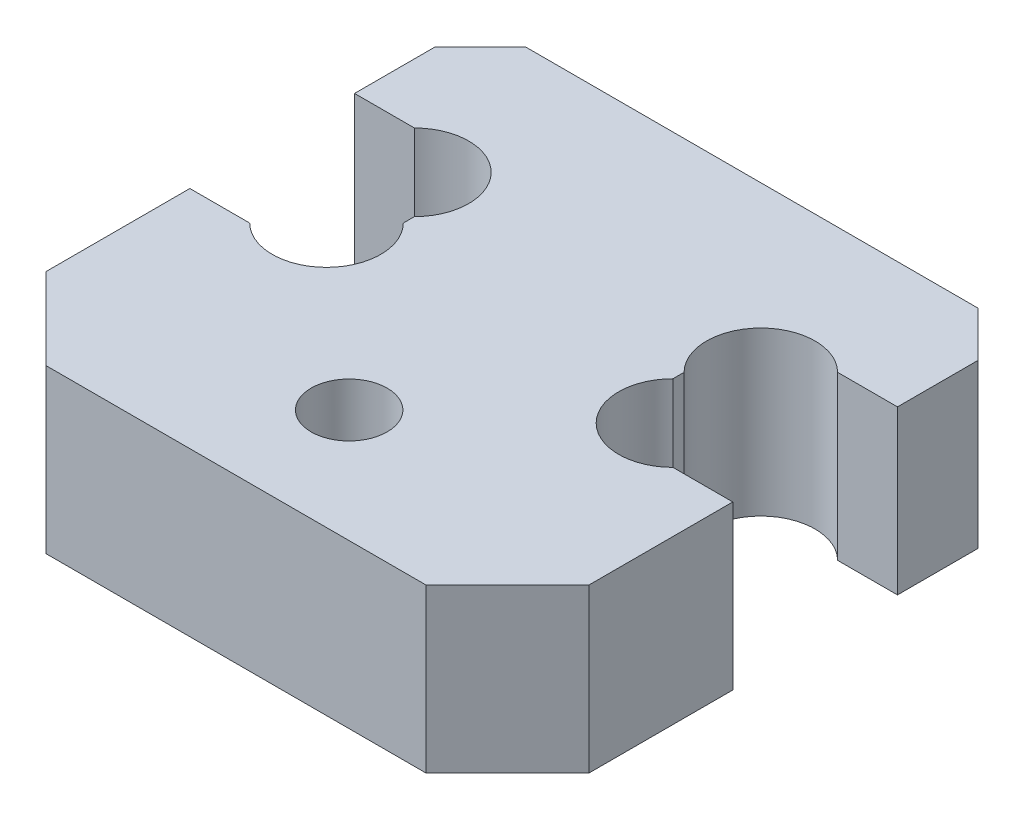
ISO-10303-21;
HEADER;
FILE_DESCRIPTION(('STEP AP214'),'2;1');
FILE_NAME('part.step','',(''),(''),'','','');
FILE_SCHEMA(('AUTOMOTIVE_DESIGN { 1 0 10303 214 1 1 1 1 }'));
ENDSEC;
DATA;
#1=APPLICATION_CONTEXT('core data for automotive mechanical design processes');
#2=APPLICATION_PROTOCOL_DEFINITION('international standard','automotive_design',2000,#1);
#3=PRODUCT_CONTEXT('',#1,'mechanical');
#4=PRODUCT('Part','Part','',(#3));
#5=PRODUCT_RELATED_PRODUCT_CATEGORY('part','',(#4));
#6=PRODUCT_DEFINITION_FORMATION('','',#4);
#7=PRODUCT_DEFINITION_CONTEXT('part definition',#1,'design');
#8=PRODUCT_DEFINITION('design','',#6,#7);
#9=PRODUCT_DEFINITION_SHAPE('','',#8);
#10=(LENGTH_UNIT() NAMED_UNIT(*) SI_UNIT(.MILLI.,.METRE.));
#11=(NAMED_UNIT(*) PLANE_ANGLE_UNIT() SI_UNIT($,.RADIAN.));
#12=(NAMED_UNIT(*) SI_UNIT($,.STERADIAN.) SOLID_ANGLE_UNIT());
#13=UNCERTAINTY_MEASURE_WITH_UNIT(LENGTH_MEASURE(1.E-05),#10,'distance_accuracy_value','');
#14=(GEOMETRIC_REPRESENTATION_CONTEXT(3) GLOBAL_UNCERTAINTY_ASSIGNED_CONTEXT((#13)) GLOBAL_UNIT_ASSIGNED_CONTEXT((#10,
#11,#12)) REPRESENTATION_CONTEXT('',''));
#15=CARTESIAN_POINT('',(0.,0.,0.));
#16=DIRECTION('',(0.,0.,1.));
#17=DIRECTION('',(1.,0.,0.));
#18=AXIS2_PLACEMENT_3D('',#15,#16,#17);
#19=CARTESIAN_POINT('',(9.57132034355964,115.062,2.07132034355965));
#20=DIRECTION('',(0.,-1.,0.));
#21=DIRECTION('',(0.,0.,-1.));
#22=AXIS2_PLACEMENT_3D('',#19,#20,#21);
#23=CYLINDRICAL_SURFACE('',#22,3.);
#24=DIRECTION('',(0.,-1.,0.));
#25=VECTOR('',#24,1.);
#26=CARTESIAN_POINT('',(11.6926406871193,115.062,-0.05));
#27=LINE('',#26,#25);
#28=CARTESIAN_POINT('',(11.6926406871193,115.06,-0.05));
#29=VERTEX_POINT('',#28);
#30=CARTESIAN_POINT('',(11.6926406871193,106.06,-0.05));
#31=VERTEX_POINT('',#30);
#32=EDGE_CURVE('E354',#29,#31,#27,.T.);
#33=ORIENTED_EDGE('',*,*,#32,.F.);
#34=CARTESIAN_POINT('',(9.57132034355964,115.06,2.07132034355965));
#35=DIRECTION('',(0.,1.,0.));
#36=DIRECTION('',(0.,0.,1.));
#37=AXIS2_PLACEMENT_3D('',#34,#35,#36);
#38=CIRCLE('',#37,3.);
#39=CARTESIAN_POINT('',(7.45,115.06,4.19264068711929));
#40=VERTEX_POINT('',#39);
#41=EDGE_CURVE('E303',#29,#40,#38,.T.);
#42=ORIENTED_EDGE('',*,*,#41,.T.);
#43=DIRECTION('',(0.,-1.,0.));
#44=VECTOR('',#43,1.);
#45=CARTESIAN_POINT('',(7.45,115.062,4.19264068711929));
#46=LINE('',#45,#44);
#47=CARTESIAN_POINT('',(7.45,106.06,4.19264068711929));
#48=VERTEX_POINT('',#47);
#49=EDGE_CURVE('E351',#40,#48,#46,.T.);
#50=ORIENTED_EDGE('',*,*,#49,.T.);
#51=CARTESIAN_POINT('',(9.57132034355964,106.06,2.07132034355965));
#52=DIRECTION('',(0.,1.,0.));
#53=DIRECTION('',(0.,0.,-1.));
#54=AXIS2_PLACEMENT_3D('',#51,#52,#53);
#55=CIRCLE('',#54,3.);
#56=EDGE_CURVE('E298',#31,#48,#55,.T.);
#57=ORIENTED_EDGE('',*,*,#56,.F.);
#58=EDGE_LOOP('',(#33,#42,#50,#57));
#59=FACE_BOUND('',#58,.T.);
#60=ADVANCED_FACE('F16',(#59),#23,.F.);
#61=CARTESIAN_POINT('',(-9.57132034355964,115.062,2.07132034355963));
#62=DIRECTION('',(0.,-1.,0.));
#63=DIRECTION('',(0.,0.,-1.));
#64=AXIS2_PLACEMENT_3D('',#61,#62,#63);
#65=CYLINDRICAL_SURFACE('',#64,3.);
#66=CARTESIAN_POINT('',(-9.57132034355964,106.06,2.07132034355963));
#67=DIRECTION('',(0.,-1.,0.));
#68=DIRECTION('',(0.,0.,-1.));
#69=AXIS2_PLACEMENT_3D('',#66,#67,#68);
#70=CIRCLE('',#69,3.);
#71=CARTESIAN_POINT('',(-11.6926406871193,106.06,-0.05));
#72=VERTEX_POINT('',#71);
#73=CARTESIAN_POINT('',(-7.45,106.06,4.19264068711928));
#74=VERTEX_POINT('',#73);
#75=EDGE_CURVE('E309',#72,#74,#70,.T.);
#76=ORIENTED_EDGE('',*,*,#75,.T.);
#77=DIRECTION('',(0.,-1.,0.));
#78=VECTOR('',#77,1.);
#79=CARTESIAN_POINT('',(-7.45,115.062,4.19264068711928));
#80=LINE('',#79,#78);
#81=CARTESIAN_POINT('',(-7.45,115.06,4.19264068711928));
#82=VERTEX_POINT('',#81);
#83=EDGE_CURVE('E279',#82,#74,#80,.T.);
#84=ORIENTED_EDGE('',*,*,#83,.F.);
#85=CARTESIAN_POINT('',(-9.57132034355964,115.06,2.07132034355963));
#86=DIRECTION('',(0.,-1.,0.));
#87=DIRECTION('',(0.,0.,1.));
#88=AXIS2_PLACEMENT_3D('',#85,#86,#87);
#89=CIRCLE('',#88,3.);
#90=CARTESIAN_POINT('',(-11.6926406871193,115.06,-0.05));
#91=VERTEX_POINT('',#90);
#92=EDGE_CURVE('E406',#91,#82,#89,.T.);
#93=ORIENTED_EDGE('',*,*,#92,.F.);
#94=DIRECTION('',(0.,-1.,0.));
#95=VECTOR('',#94,1.);
#96=CARTESIAN_POINT('',(-11.6926406871193,115.062,-0.05));
#97=LINE('',#96,#95);
#98=EDGE_CURVE('E276',#91,#72,#97,.T.);
#99=ORIENTED_EDGE('',*,*,#98,.T.);
#100=EDGE_LOOP('',(#76,#84,#93,#99));
#101=FACE_BOUND('',#100,.T.);
#102=ADVANCED_FACE('F466',(#101),#65,.F.);
#103=CARTESIAN_POINT('',(-9.57132034355964,115.062,6.92867965644036));
#104=DIRECTION('',(0.,-1.,0.));
#105=DIRECTION('',(0.,0.,-1.));
#106=AXIS2_PLACEMENT_3D('',#103,#104,#105);
#107=CYLINDRICAL_SURFACE('',#106,3.);
#108=CARTESIAN_POINT('',(-9.57132034355964,115.06,6.92867965644036));
#109=DIRECTION('',(0.,1.,0.));
#110=DIRECTION('',(0.,0.,1.));
#111=AXIS2_PLACEMENT_3D('',#108,#109,#110);
#112=CIRCLE('',#111,3.);
#113=CARTESIAN_POINT('',(-11.6926406871193,115.06,9.05));
#114=VERTEX_POINT('',#113);
#115=CARTESIAN_POINT('',(-7.45,115.06,4.80735931288072));
#116=VERTEX_POINT('',#115);
#117=EDGE_CURVE('E316',#114,#116,#112,.T.);
#118=ORIENTED_EDGE('',*,*,#117,.T.);
#119=DIRECTION('',(0.,-1.,0.));
#120=VECTOR('',#119,1.);
#121=CARTESIAN_POINT('',(-7.45,115.062,4.80735931288072));
#122=LINE('',#121,#120);
#123=CARTESIAN_POINT('',(-7.45,106.06,4.80735931288072));
#124=VERTEX_POINT('',#123);
#125=EDGE_CURVE('E244',#116,#124,#122,.T.);
#126=ORIENTED_EDGE('',*,*,#125,.T.);
#127=CARTESIAN_POINT('',(-9.57132034355964,106.06,6.92867965644036));
#128=DIRECTION('',(0.,1.,0.));
#129=DIRECTION('',(0.,0.,-1.));
#130=AXIS2_PLACEMENT_3D('',#127,#128,#129);
#131=CIRCLE('',#130,3.);
#132=CARTESIAN_POINT('',(-11.6926406871193,106.06,9.05));
#133=VERTEX_POINT('',#132);
#134=EDGE_CURVE('E247',#133,#124,#131,.T.);
#135=ORIENTED_EDGE('',*,*,#134,.F.);
#136=DIRECTION('',(0.,-1.,0.));
#137=VECTOR('',#136,1.);
#138=CARTESIAN_POINT('',(-11.6926406871193,115.062,9.05));
#139=LINE('',#138,#137);
#140=EDGE_CURVE('E232',#114,#133,#139,.T.);
#141=ORIENTED_EDGE('',*,*,#140,.F.);
#142=EDGE_LOOP('',(#118,#126,#135,#141));
#143=FACE_BOUND('',#142,.T.);
#144=ADVANCED_FACE('F248',(#143),#107,.F.);
#145=CARTESIAN_POINT('',(9.57132034355964,115.062,6.92867965644036));
#146=DIRECTION('',(0.,-1.,0.));
#147=DIRECTION('',(0.,0.,-1.));
#148=AXIS2_PLACEMENT_3D('',#145,#146,#147);
#149=CYLINDRICAL_SURFACE('',#148,3.);
#150=CARTESIAN_POINT('',(9.57132034355964,115.06,6.92867965644036));
#151=DIRECTION('',(0.,-1.,0.));
#152=DIRECTION('',(0.,0.,1.));
#153=AXIS2_PLACEMENT_3D('',#150,#151,#152);
#154=CIRCLE('',#153,3.);
#155=CARTESIAN_POINT('',(11.6926406871193,115.06,9.05));
#156=VERTEX_POINT('',#155);
#157=CARTESIAN_POINT('',(7.45,115.06,4.80735931288072));
#158=VERTEX_POINT('',#157);
#159=EDGE_CURVE('E304',#156,#158,#154,.T.);
#160=ORIENTED_EDGE('',*,*,#159,.F.);
#161=DIRECTION('',(0.,-1.,0.));
#162=VECTOR('',#161,1.);
#163=CARTESIAN_POINT('',(11.6926406871193,115.062,9.05));
#164=LINE('',#163,#162);
#165=CARTESIAN_POINT('',(11.6926406871193,106.06,9.05));
#166=VERTEX_POINT('',#165);
#167=EDGE_CURVE('E11',#156,#166,#164,.T.);
#168=ORIENTED_EDGE('',*,*,#167,.T.);
#169=CARTESIAN_POINT('',(9.57132034355964,106.06,6.92867965644036));
#170=DIRECTION('',(0.,-1.,0.));
#171=DIRECTION('',(0.,0.,-1.));
#172=AXIS2_PLACEMENT_3D('',#169,#170,#171);
#173=CIRCLE('',#172,3.);
#174=CARTESIAN_POINT('',(7.45,106.06,4.80735931288072));
#175=VERTEX_POINT('',#174);
#176=EDGE_CURVE('E308',#166,#175,#173,.T.);
#177=ORIENTED_EDGE('',*,*,#176,.T.);
#178=DIRECTION('',(0.,-1.,0.));
#179=VECTOR('',#178,1.);
#180=CARTESIAN_POINT('',(7.45,115.062,4.80735931288072));
#181=LINE('',#180,#179);
#182=EDGE_CURVE('E355',#158,#175,#181,.T.);
#183=ORIENTED_EDGE('',*,*,#182,.F.);
#184=EDGE_LOOP('',(#160,#168,#177,#183));
#185=FACE_BOUND('',#184,.T.);
#186=ADVANCED_FACE('F490',(#185),#149,.F.);
#187=CARTESIAN_POINT('',(0.,115.062,15.25));
#188=DIRECTION('',(0.,-1.,0.));
#189=DIRECTION('',(0.,0.,-1.));
#190=AXIS2_PLACEMENT_3D('',#187,#188,#189);
#191=CYLINDRICAL_SURFACE('',#190,2.1);
#192=CARTESIAN_POINT('',(0.,115.06,15.25));
#193=DIRECTION('',(0.,-1.,0.));
#194=DIRECTION('',(0.,0.,1.));
#195=AXIS2_PLACEMENT_3D('',#192,#193,#194);
#196=CIRCLE('',#195,2.1);
#197=CARTESIAN_POINT('',(0.,115.06,17.35));
#198=VERTEX_POINT('',#197);
#199=EDGE_CURVE('E297',#198,#198,#196,.T.);
#200=ORIENTED_EDGE('',*,*,#199,.F.);
#201=EDGE_LOOP('',(#200));
#202=FACE_BOUND('',#201,.T.);
#203=CARTESIAN_POINT('',(0.,106.06,15.25));
#204=DIRECTION('',(0.,-1.,0.));
#205=DIRECTION('',(0.,0.,-1.));
#206=AXIS2_PLACEMENT_3D('',#203,#204,#205);
#207=CIRCLE('',#206,2.1);
#208=CARTESIAN_POINT('',(0.,106.06,13.15));
#209=VERTEX_POINT('',#208);
#210=EDGE_CURVE('E305',#209,#209,#207,.T.);
#211=ORIENTED_EDGE('',*,*,#210,.T.);
#212=EDGE_LOOP('',(#211));
#213=FACE_BOUND('',#212,.T.);
#214=ADVANCED_FACE('F18',(#202,#213),#191,.F.);
#215=CARTESIAN_POINT('',(10.5,26.7449246614837,21.5));
#216=DIRECTION('',(0.707106781186548,0.,0.707106781186548));
#217=DIRECTION('',(0.,-1.,0.));
#218=AXIS2_PLACEMENT_3D('',#215,#216,#217);
#219=PLANE('',#218);
#220=DIRECTION('',(-0.707106781186548,0.,0.707106781186548));
#221=VECTOR('',#220,1.);
#222=CARTESIAN_POINT('',(10.5,106.06,21.5));
#223=LINE('',#222,#221);
#224=CARTESIAN_POINT('',(15.,106.06,17.));
#225=VERTEX_POINT('',#224);
#226=CARTESIAN_POINT('',(10.5,106.06,21.5));
#227=VERTEX_POINT('',#226);
#228=EDGE_CURVE('E332',#225,#227,#223,.T.);
#229=ORIENTED_EDGE('',*,*,#228,.F.);
#230=DIRECTION('',(0.,-1.,0.));
#231=VECTOR('',#230,1.);
#232=CARTESIAN_POINT('',(15.,106.06,17.));
#233=LINE('',#232,#231);
#234=CARTESIAN_POINT('',(15.,115.06,17.));
#235=VERTEX_POINT('',#234);
#236=EDGE_CURVE('E39',#235,#225,#233,.T.);
#237=ORIENTED_EDGE('',*,*,#236,.F.);
#238=DIRECTION('',(0.707106781186548,0.,-0.707106781186548));
#239=VECTOR('',#238,1.);
#240=CARTESIAN_POINT('',(19.5,115.06,12.5));
#241=LINE('',#240,#239);
#242=CARTESIAN_POINT('',(10.5,115.06,21.5));
#243=VERTEX_POINT('',#242);
#244=EDGE_CURVE('E364',#243,#235,#241,.T.);
#245=ORIENTED_EDGE('',*,*,#244,.F.);
#246=DIRECTION('',(0.,1.,0.));
#247=VECTOR('',#246,1.);
#248=CARTESIAN_POINT('',(10.5,115.06,21.5));
#249=LINE('',#248,#247);
#250=EDGE_CURVE('E26',#227,#243,#249,.T.);
#251=ORIENTED_EDGE('',*,*,#250,.F.);
#252=EDGE_LOOP('',(#229,#237,#245,#251));
#253=FACE_BOUND('',#252,.T.);
#254=ADVANCED_FACE('F551',(#253),#219,.T.);
#255=CARTESIAN_POINT('',(-15.,110.56,17.));
#256=DIRECTION('',(0.707106781186548,0.,-0.707106781186548));
#257=DIRECTION('',(0.,-1.,0.));
#258=AXIS2_PLACEMENT_3D('',#255,#256,#257);
#259=PLANE('',#258);
#260=DIRECTION('',(-0.707106781186548,0.,-0.707106781186548));
#261=VECTOR('',#260,1.);
#262=CARTESIAN_POINT('',(-15.,106.06,17.));
#263=LINE('',#262,#261);
#264=CARTESIAN_POINT('',(-10.5,106.06,21.5));
#265=VERTEX_POINT('',#264);
#266=CARTESIAN_POINT('',(-15.,106.06,17.));
#267=VERTEX_POINT('',#266);
#268=EDGE_CURVE('E266',#265,#267,#263,.T.);
#269=ORIENTED_EDGE('',*,*,#268,.F.);
#270=DIRECTION('',(0.,-1.,0.));
#271=VECTOR('',#270,1.);
#272=CARTESIAN_POINT('',(-10.5,26.7449246614837,21.5));
#273=LINE('',#272,#271);
#274=CARTESIAN_POINT('',(-10.5,115.06,21.5));
#275=VERTEX_POINT('',#274);
#276=EDGE_CURVE('E347',#275,#265,#273,.T.);
#277=ORIENTED_EDGE('',*,*,#276,.F.);
#278=DIRECTION('',(0.707106781186548,0.,0.707106781186548));
#279=VECTOR('',#278,1.);
#280=CARTESIAN_POINT('',(-19.5,115.06,12.5));
#281=LINE('',#280,#279);
#282=CARTESIAN_POINT('',(-15.,115.06,17.));
#283=VERTEX_POINT('',#282);
#284=EDGE_CURVE('E445',#283,#275,#281,.T.);
#285=ORIENTED_EDGE('',*,*,#284,.F.);
#286=DIRECTION('',(0.,1.,0.));
#287=VECTOR('',#286,1.);
#288=CARTESIAN_POINT('',(-15.,110.56,17.));
#289=LINE('',#288,#287);
#290=EDGE_CURVE('E350',#267,#283,#289,.T.);
#291=ORIENTED_EDGE('',*,*,#290,.F.);
#292=EDGE_LOOP('',(#269,#277,#285,#291));
#293=FACE_BOUND('',#292,.T.);
#294=ADVANCED_FACE('F498',(#293),#259,.F.);
#295=CARTESIAN_POINT('',(15.,110.56,-4.5));
#296=DIRECTION('',(0.707106781186548,0.,-0.707106781186548));
#297=DIRECTION('',(0.,-1.,0.));
#298=AXIS2_PLACEMENT_3D('',#295,#296,#297);
#299=PLANE('',#298);
#300=DIRECTION('',(0.707106781186548,0.,0.707106781186548));
#301=VECTOR('',#300,1.);
#302=CARTESIAN_POINT('',(15.,106.06,-4.5));
#303=LINE('',#302,#301);
#304=CARTESIAN_POINT('',(12.5,106.06,-7.));
#305=VERTEX_POINT('',#304);
#306=CARTESIAN_POINT('',(15.,106.06,-4.5));
#307=VERTEX_POINT('',#306);
#308=EDGE_CURVE('E333',#305,#307,#303,.T.);
#309=ORIENTED_EDGE('',*,*,#308,.F.);
#310=DIRECTION('',(0.,-1.,0.));
#311=VECTOR('',#310,1.);
#312=CARTESIAN_POINT('',(12.5,106.06,-7.));
#313=LINE('',#312,#311);
#314=CARTESIAN_POINT('',(12.5,115.06,-7.));
#315=VERTEX_POINT('',#314);
#316=EDGE_CURVE('E280',#315,#305,#313,.T.);
#317=ORIENTED_EDGE('',*,*,#316,.F.);
#318=DIRECTION('',(-0.707106781186548,0.,-0.707106781186548));
#319=VECTOR('',#318,1.);
#320=CARTESIAN_POINT('',(6.25,115.06,-13.25));
#321=LINE('',#320,#319);
#322=CARTESIAN_POINT('',(15.,115.06,-4.5));
#323=VERTEX_POINT('',#322);
#324=EDGE_CURVE('E269',#323,#315,#321,.T.);
#325=ORIENTED_EDGE('',*,*,#324,.F.);
#326=DIRECTION('',(0.,1.,0.));
#327=VECTOR('',#326,1.);
#328=CARTESIAN_POINT('',(15.,115.06,-4.5));
#329=LINE('',#328,#327);
#330=EDGE_CURVE('E323',#307,#323,#329,.T.);
#331=ORIENTED_EDGE('',*,*,#330,.F.);
#332=EDGE_LOOP('',(#309,#317,#325,#331));
#333=FACE_BOUND('',#332,.T.);
#334=ADVANCED_FACE('F494',(#333),#299,.T.);
#335=CARTESIAN_POINT('',(-12.5,26.7449246614837,-7.));
#336=DIRECTION('',(0.707106781186548,0.,0.707106781186548));
#337=DIRECTION('',(0.,-1.,0.));
#338=AXIS2_PLACEMENT_3D('',#335,#336,#337);
#339=PLANE('',#338);
#340=DIRECTION('',(0.707106781186548,0.,-0.707106781186548));
#341=VECTOR('',#340,1.);
#342=CARTESIAN_POINT('',(-12.5,106.06,-7.));
#343=LINE('',#342,#341);
#344=CARTESIAN_POINT('',(-15.,106.06,-4.5));
#345=VERTEX_POINT('',#344);
#346=CARTESIAN_POINT('',(-12.5,106.06,-7.));
#347=VERTEX_POINT('',#346);
#348=EDGE_CURVE('E342',#345,#347,#343,.T.);
#349=ORIENTED_EDGE('',*,*,#348,.F.);
#350=DIRECTION('',(0.,-1.,0.));
#351=VECTOR('',#350,1.);
#352=CARTESIAN_POINT('',(-15.,110.56,-4.5));
#353=LINE('',#352,#351);
#354=CARTESIAN_POINT('',(-15.,115.06,-4.5));
#355=VERTEX_POINT('',#354);
#356=EDGE_CURVE('E167',#355,#345,#353,.T.);
#357=ORIENTED_EDGE('',*,*,#356,.F.);
#358=DIRECTION('',(-0.707106781186548,0.,0.707106781186548));
#359=VECTOR('',#358,1.);
#360=CARTESIAN_POINT('',(-6.25,115.06,-13.25));
#361=LINE('',#360,#359);
#362=CARTESIAN_POINT('',(-12.5,115.06,-7.));
#363=VERTEX_POINT('',#362);
#364=EDGE_CURVE('E284',#363,#355,#361,.T.);
#365=ORIENTED_EDGE('',*,*,#364,.F.);
#366=DIRECTION('',(0.,1.,0.));
#367=VECTOR('',#366,1.);
#368=CARTESIAN_POINT('',(-12.5,26.7449246614837,-7.));
#369=LINE('',#368,#367);
#370=EDGE_CURVE('E290',#347,#363,#369,.T.);
#371=ORIENTED_EDGE('',*,*,#370,.F.);
#372=EDGE_LOOP('',(#349,#357,#365,#371));
#373=FACE_BOUND('',#372,.T.);
#374=ADVANCED_FACE('F497',(#373),#339,.F.);
#375=CARTESIAN_POINT('',(3.05311331771918E-13,26.7449246614837,9.05));
#376=DIRECTION('',(0.,0.,1.));
#377=DIRECTION('',(1.,0.,0.));
#378=AXIS2_PLACEMENT_3D('',#375,#376,#377);
#379=PLANE('',#378);
#380=DIRECTION('',(-1.,0.,0.));
#381=VECTOR('',#380,1.);
#382=CARTESIAN_POINT('',(3.05311331771918E-13,106.06,9.05));
#383=LINE('',#382,#381);
#384=CARTESIAN_POINT('',(15.,106.06,9.05));
#385=VERTEX_POINT('',#384);
#386=EDGE_CURVE('E320',#385,#166,#383,.T.);
#387=ORIENTED_EDGE('',*,*,#386,.T.);
#388=ORIENTED_EDGE('',*,*,#167,.F.);
#389=DIRECTION('',(-1.,0.,0.));
#390=VECTOR('',#389,1.);
#391=CARTESIAN_POINT('',(3.05311331771918E-13,115.06,9.05));
#392=LINE('',#391,#390);
#393=CARTESIAN_POINT('',(15.,115.06,9.05));
#394=VERTEX_POINT('',#393);
#395=EDGE_CURVE('E324',#394,#156,#392,.T.);
#396=ORIENTED_EDGE('',*,*,#395,.F.);
#397=DIRECTION('',(0.,1.,0.));
#398=VECTOR('',#397,1.);
#399=CARTESIAN_POINT('',(15.,110.56,9.05));
#400=LINE('',#399,#398);
#401=EDGE_CURVE('E200',#385,#394,#400,.T.);
#402=ORIENTED_EDGE('',*,*,#401,.F.);
#403=EDGE_LOOP('',(#387,#388,#396,#402));
#404=FACE_BOUND('',#403,.T.);
#405=ADVANCED_FACE('F539',(#404),#379,.F.);
#406=CARTESIAN_POINT('',(3.05311331771918E-13,26.7449246614837,21.5));
#407=DIRECTION('',(0.,0.,1.));
#408=DIRECTION('',(1.,0.,0.));
#409=AXIS2_PLACEMENT_3D('',#406,#407,#408);
#410=PLANE('',#409);
#411=DIRECTION('',(-1.,0.,0.));
#412=VECTOR('',#411,1.);
#413=CARTESIAN_POINT('',(-11.25,115.06,21.5));
#414=LINE('',#413,#412);
#415=EDGE_CURVE('E369',#243,#275,#414,.T.);
#416=ORIENTED_EDGE('',*,*,#415,.T.);
#417=ORIENTED_EDGE('',*,*,#276,.T.);
#418=DIRECTION('',(-1.,0.,0.));
#419=VECTOR('',#418,1.);
#420=CARTESIAN_POINT('',(-11.25,106.06,21.5));
#421=LINE('',#420,#419);
#422=EDGE_CURVE('E328',#227,#265,#421,.T.);
#423=ORIENTED_EDGE('',*,*,#422,.F.);
#424=ORIENTED_EDGE('',*,*,#250,.T.);
#425=EDGE_LOOP('',(#416,#417,#423,#424));
#426=FACE_BOUND('',#425,.T.);
#427=ADVANCED_FACE('F504',(#426),#410,.T.);
#428=CARTESIAN_POINT('',(-15.,110.56,21.5));
#429=DIRECTION('',(-1.,0.,0.));
#430=DIRECTION('',(0.,0.,1.));
#431=AXIS2_PLACEMENT_3D('',#428,#429,#430);
#432=PLANE('',#431);
#433=DIRECTION('',(0.,0.,-1.));
#434=VECTOR('',#433,1.);
#435=CARTESIAN_POINT('',(-15.,106.06,21.5));
#436=LINE('',#435,#434);
#437=CARTESIAN_POINT('',(-15.,106.06,9.05));
#438=VERTEX_POINT('',#437);
#439=EDGE_CURVE('E20',#267,#438,#436,.T.);
#440=ORIENTED_EDGE('',*,*,#439,.F.);
#441=ORIENTED_EDGE('',*,*,#290,.T.);
#442=DIRECTION('',(0.,0.,-1.));
#443=VECTOR('',#442,1.);
#444=CARTESIAN_POINT('',(-15.,115.06,21.5));
#445=LINE('',#444,#443);
#446=CARTESIAN_POINT('',(-15.,115.06,9.05));
#447=VERTEX_POINT('',#446);
#448=EDGE_CURVE('E315',#283,#447,#445,.T.);
#449=ORIENTED_EDGE('',*,*,#448,.T.);
#450=DIRECTION('',(0.,1.,0.));
#451=VECTOR('',#450,1.);
#452=CARTESIAN_POINT('',(-15.,110.56,9.05));
#453=LINE('',#452,#451);
#454=EDGE_CURVE('E225',#438,#447,#453,.T.);
#455=ORIENTED_EDGE('',*,*,#454,.F.);
#456=EDGE_LOOP('',(#440,#441,#449,#455));
#457=FACE_BOUND('',#456,.T.);
#458=ADVANCED_FACE('F500',(#457),#432,.T.);
#459=CARTESIAN_POINT('',(15.,110.56,21.5));
#460=DIRECTION('',(-1.,0.,0.));
#461=DIRECTION('',(0.,0.,1.));
#462=AXIS2_PLACEMENT_3D('',#459,#460,#461);
#463=PLANE('',#462);
#464=DIRECTION('',(0.,0.,-1.));
#465=VECTOR('',#464,1.);
#466=CARTESIAN_POINT('',(15.,115.06,21.5));
#467=LINE('',#466,#465);
#468=EDGE_CURVE('E368',#235,#394,#467,.T.);
#469=ORIENTED_EDGE('',*,*,#468,.F.);
#470=ORIENTED_EDGE('',*,*,#236,.T.);
#471=DIRECTION('',(0.,0.,-1.));
#472=VECTOR('',#471,1.);
#473=CARTESIAN_POINT('',(15.,106.06,21.5));
#474=LINE('',#473,#472);
#475=EDGE_CURVE('E393',#225,#385,#474,.T.);
#476=ORIENTED_EDGE('',*,*,#475,.T.);
#477=ORIENTED_EDGE('',*,*,#401,.T.);
#478=EDGE_LOOP('',(#469,#470,#476,#477));
#479=FACE_BOUND('',#478,.T.);
#480=ADVANCED_FACE('F503',(#479),#463,.F.);
#481=CARTESIAN_POINT('',(3.05311331771918E-13,26.7449246614837,9.05));
#482=DIRECTION('',(0.,0.,1.));
#483=DIRECTION('',(1.,0.,0.));
#484=AXIS2_PLACEMENT_3D('',#481,#482,#483);
#485=PLANE('',#484);
#486=DIRECTION('',(-1.,0.,0.));
#487=VECTOR('',#486,1.);
#488=CARTESIAN_POINT('',(3.05311331771918E-13,115.06,9.05));
#489=LINE('',#488,#487);
#490=EDGE_CURVE('E239',#114,#447,#489,.T.);
#491=ORIENTED_EDGE('',*,*,#490,.F.);
#492=ORIENTED_EDGE('',*,*,#140,.T.);
#493=DIRECTION('',(-1.,0.,0.));
#494=VECTOR('',#493,1.);
#495=CARTESIAN_POINT('',(3.05311331771918E-13,106.06,9.05));
#496=LINE('',#495,#494);
#497=EDGE_CURVE('E236',#133,#438,#496,.T.);
#498=ORIENTED_EDGE('',*,*,#497,.T.);
#499=ORIENTED_EDGE('',*,*,#454,.T.);
#500=EDGE_LOOP('',(#491,#492,#498,#499));
#501=FACE_BOUND('',#500,.T.);
#502=ADVANCED_FACE('F234',(#501),#485,.F.);
#503=CARTESIAN_POINT('',(-7.45,113.388427124746,9.));
#504=DIRECTION('',(1.,0.,0.));
#505=DIRECTION('',(0.,1.,0.));
#506=AXIS2_PLACEMENT_3D('',#503,#504,#505);
#507=PLANE('',#506);
#508=DIRECTION('',(0.,0.,-1.));
#509=VECTOR('',#508,1.);
#510=CARTESIAN_POINT('',(-7.45,115.06,-7.));
#511=LINE('',#510,#509);
#512=EDGE_CURVE('E414',#116,#82,#511,.T.);
#513=ORIENTED_EDGE('',*,*,#512,.T.);
#514=ORIENTED_EDGE('',*,*,#83,.T.);
#515=DIRECTION('',(0.,0.,-1.));
#516=VECTOR('',#515,1.);
#517=CARTESIAN_POINT('',(-7.45,106.06,-7.));
#518=LINE('',#517,#516);
#519=EDGE_CURVE('E253',#124,#74,#518,.T.);
#520=ORIENTED_EDGE('',*,*,#519,.F.);
#521=ORIENTED_EDGE('',*,*,#125,.F.);
#522=EDGE_LOOP('',(#513,#514,#520,#521));
#523=FACE_BOUND('',#522,.T.);
#524=ADVANCED_FACE('F462',(#523),#507,.F.);
#525=CARTESIAN_POINT('',(3.05311331771918E-13,26.7449246614837,-0.05));
#526=DIRECTION('',(0.,0.,1.));
#527=DIRECTION('',(1.,0.,0.));
#528=AXIS2_PLACEMENT_3D('',#525,#526,#527);
#529=PLANE('',#528);
#530=ORIENTED_EDGE('',*,*,#98,.F.);
#531=DIRECTION('',(-1.,0.,0.));
#532=VECTOR('',#531,1.);
#533=CARTESIAN_POINT('',(3.05311331771918E-13,115.06,-0.05));
#534=LINE('',#533,#532);
#535=CARTESIAN_POINT('',(-15.,115.06,-0.05));
#536=VERTEX_POINT('',#535);
#537=EDGE_CURVE('E404',#91,#536,#534,.T.);
#538=ORIENTED_EDGE('',*,*,#537,.T.);
#539=DIRECTION('',(0.,1.,0.));
#540=VECTOR('',#539,1.);
#541=CARTESIAN_POINT('',(-15.,26.7449246614837,-0.05));
#542=LINE('',#541,#540);
#543=CARTESIAN_POINT('',(-15.,106.06,-0.05));
#544=VERTEX_POINT('',#543);
#545=EDGE_CURVE('E151',#544,#536,#542,.T.);
#546=ORIENTED_EDGE('',*,*,#545,.F.);
#547=DIRECTION('',(-1.,0.,0.));
#548=VECTOR('',#547,1.);
#549=CARTESIAN_POINT('',(3.05311331771918E-13,106.06,-0.05));
#550=LINE('',#549,#548);
#551=EDGE_CURVE('E311',#72,#544,#550,.T.);
#552=ORIENTED_EDGE('',*,*,#551,.F.);
#553=EDGE_LOOP('',(#530,#538,#546,#552));
#554=FACE_BOUND('',#553,.T.);
#555=ADVANCED_FACE('F468',(#554),#529,.T.);
#556=CARTESIAN_POINT('',(3.05311331771918E-13,26.7449246614837,-7.));
#557=DIRECTION('',(0.,0.,1.));
#558=DIRECTION('',(1.,0.,0.));
#559=AXIS2_PLACEMENT_3D('',#556,#557,#558);
#560=PLANE('',#559);
#561=DIRECTION('',(-1.,0.,0.));
#562=VECTOR('',#561,1.);
#563=CARTESIAN_POINT('',(-4.67157287525377,106.06,-7.));
#564=LINE('',#563,#562);
#565=EDGE_CURVE('E338',#305,#347,#564,.T.);
#566=ORIENTED_EDGE('',*,*,#565,.T.);
#567=ORIENTED_EDGE('',*,*,#370,.T.);
#568=DIRECTION('',(-1.,0.,0.));
#569=VECTOR('',#568,1.);
#570=CARTESIAN_POINT('',(1.12757025938492E-13,115.06,-7.));
#571=LINE('',#570,#569);
#572=EDGE_CURVE('E281',#315,#363,#571,.T.);
#573=ORIENTED_EDGE('',*,*,#572,.F.);
#574=ORIENTED_EDGE('',*,*,#316,.T.);
#575=EDGE_LOOP('',(#566,#567,#573,#574));
#576=FACE_BOUND('',#575,.T.);
#577=ADVANCED_FACE('F470',(#576),#560,.F.);
#578=CARTESIAN_POINT('',(-15.,110.56,-7.));
#579=DIRECTION('',(1.,0.,0.));
#580=DIRECTION('',(0.,1.,0.));
#581=AXIS2_PLACEMENT_3D('',#578,#579,#580);
#582=PLANE('',#581);
#583=DIRECTION('',(0.,0.,1.));
#584=VECTOR('',#583,1.);
#585=CARTESIAN_POINT('',(-15.,115.06,-7.));
#586=LINE('',#585,#584);
#587=EDGE_CURVE('E289',#355,#536,#586,.T.);
#588=ORIENTED_EDGE('',*,*,#587,.F.);
#589=ORIENTED_EDGE('',*,*,#356,.T.);
#590=DIRECTION('',(0.,0.,1.));
#591=VECTOR('',#590,1.);
#592=CARTESIAN_POINT('',(-15.,106.06,-7.));
#593=LINE('',#592,#591);
#594=EDGE_CURVE('E376',#345,#544,#593,.T.);
#595=ORIENTED_EDGE('',*,*,#594,.T.);
#596=ORIENTED_EDGE('',*,*,#545,.T.);
#597=EDGE_LOOP('',(#588,#589,#595,#596));
#598=FACE_BOUND('',#597,.T.);
#599=ADVANCED_FACE('F476',(#598),#582,.F.);
#600=CARTESIAN_POINT('',(15.,110.56,-7.));
#601=DIRECTION('',(1.,0.,0.));
#602=DIRECTION('',(0.,1.,0.));
#603=AXIS2_PLACEMENT_3D('',#600,#601,#602);
#604=PLANE('',#603);
#605=DIRECTION('',(0.,0.,1.));
#606=VECTOR('',#605,1.);
#607=CARTESIAN_POINT('',(15.,106.06,-7.));
#608=LINE('',#607,#606);
#609=CARTESIAN_POINT('',(15.,106.06,-0.05));
#610=VERTEX_POINT('',#609);
#611=EDGE_CURVE('E337',#307,#610,#608,.T.);
#612=ORIENTED_EDGE('',*,*,#611,.F.);
#613=ORIENTED_EDGE('',*,*,#330,.T.);
#614=DIRECTION('',(0.,0.,1.));
#615=VECTOR('',#614,1.);
#616=CARTESIAN_POINT('',(15.,115.06,-7.));
#617=LINE('',#616,#615);
#618=CARTESIAN_POINT('',(15.,115.06,-0.05));
#619=VERTEX_POINT('',#618);
#620=EDGE_CURVE('E271',#323,#619,#617,.T.);
#621=ORIENTED_EDGE('',*,*,#620,.T.);
#622=DIRECTION('',(0.,1.,0.));
#623=VECTOR('',#622,1.);
#624=CARTESIAN_POINT('',(15.,26.7449246614837,-0.05));
#625=LINE('',#624,#623);
#626=EDGE_CURVE('E360',#610,#619,#625,.T.);
#627=ORIENTED_EDGE('',*,*,#626,.F.);
#628=EDGE_LOOP('',(#612,#613,#621,#627));
#629=FACE_BOUND('',#628,.T.);
#630=ADVANCED_FACE('F506',(#629),#604,.T.);
#631=CARTESIAN_POINT('',(3.05311331771918E-13,26.7449246614837,-0.05));
#632=DIRECTION('',(0.,0.,1.));
#633=DIRECTION('',(1.,0.,0.));
#634=AXIS2_PLACEMENT_3D('',#631,#632,#633);
#635=PLANE('',#634);
#636=ORIENTED_EDGE('',*,*,#32,.T.);
#637=DIRECTION('',(-1.,0.,0.));
#638=VECTOR('',#637,1.);
#639=CARTESIAN_POINT('',(3.05311331771918E-13,106.06,-0.05));
#640=LINE('',#639,#638);
#641=EDGE_CURVE('E346',#610,#31,#640,.T.);
#642=ORIENTED_EDGE('',*,*,#641,.F.);
#643=ORIENTED_EDGE('',*,*,#626,.T.);
#644=DIRECTION('',(-1.,0.,0.));
#645=VECTOR('',#644,1.);
#646=CARTESIAN_POINT('',(3.05311331771918E-13,115.06,-0.05));
#647=LINE('',#646,#645);
#648=EDGE_CURVE('E275',#619,#29,#647,.T.);
#649=ORIENTED_EDGE('',*,*,#648,.T.);
#650=EDGE_LOOP('',(#636,#642,#643,#649));
#651=FACE_BOUND('',#650,.T.);
#652=ADVANCED_FACE('F509',(#651),#635,.T.);
#653=CARTESIAN_POINT('',(7.45,108.888427124746,9.));
#654=DIRECTION('',(1.,0.,0.));
#655=DIRECTION('',(0.,1.,0.));
#656=AXIS2_PLACEMENT_3D('',#653,#654,#655);
#657=PLANE('',#656);
#658=DIRECTION('',(0.,0.,-1.));
#659=VECTOR('',#658,1.);
#660=CARTESIAN_POINT('',(7.45,115.06,-7.));
#661=LINE('',#660,#659);
#662=EDGE_CURVE('E299',#158,#40,#661,.T.);
#663=ORIENTED_EDGE('',*,*,#662,.F.);
#664=ORIENTED_EDGE('',*,*,#182,.T.);
#665=DIRECTION('',(0.,0.,-1.));
#666=VECTOR('',#665,1.);
#667=CARTESIAN_POINT('',(7.45,106.06,-7.));
#668=LINE('',#667,#666);
#669=EDGE_CURVE('E293',#175,#48,#668,.T.);
#670=ORIENTED_EDGE('',*,*,#669,.T.);
#671=ORIENTED_EDGE('',*,*,#49,.F.);
#672=EDGE_LOOP('',(#663,#664,#670,#671));
#673=FACE_BOUND('',#672,.T.);
#674=ADVANCED_FACE('F548',(#673),#657,.T.);
#675=CARTESIAN_POINT('',(1.12757025938492E-13,115.06,-7.));
#676=DIRECTION('',(0.,1.,0.));
#677=DIRECTION('',(1.,0.,0.));
#678=AXIS2_PLACEMENT_3D('',#675,#676,#677);
#679=PLANE('',#678);
#680=ORIENTED_EDGE('',*,*,#395,.T.);
#681=ORIENTED_EDGE('',*,*,#159,.T.);
#682=ORIENTED_EDGE('',*,*,#662,.T.);
#683=ORIENTED_EDGE('',*,*,#41,.F.);
#684=ORIENTED_EDGE('',*,*,#648,.F.);
#685=ORIENTED_EDGE('',*,*,#620,.F.);
#686=ORIENTED_EDGE('',*,*,#324,.T.);
#687=ORIENTED_EDGE('',*,*,#572,.T.);
#688=ORIENTED_EDGE('',*,*,#364,.T.);
#689=ORIENTED_EDGE('',*,*,#587,.T.);
#690=ORIENTED_EDGE('',*,*,#537,.F.);
#691=ORIENTED_EDGE('',*,*,#92,.T.);
#692=ORIENTED_EDGE('',*,*,#512,.F.);
#693=ORIENTED_EDGE('',*,*,#117,.F.);
#694=ORIENTED_EDGE('',*,*,#490,.T.);
#695=ORIENTED_EDGE('',*,*,#448,.F.);
#696=ORIENTED_EDGE('',*,*,#284,.T.);
#697=ORIENTED_EDGE('',*,*,#415,.F.);
#698=ORIENTED_EDGE('',*,*,#244,.T.);
#699=ORIENTED_EDGE('',*,*,#468,.T.);
#700=EDGE_LOOP('',(#680,#681,#682,#683,#684,#685,#686,#687,#688,#689,#690,#691,#692,#693,#694,
#695,#696,#697,#698,#699));
#701=FACE_BOUND('',#700,.T.);
#702=ORIENTED_EDGE('',*,*,#199,.T.);
#703=EDGE_LOOP('',(#702));
#704=FACE_BOUND('',#703,.T.);
#705=ADVANCED_FACE('F512',(#701,#704),#679,.T.);
#706=CARTESIAN_POINT('',(-4.67157287525377,106.06,-7.));
#707=DIRECTION('',(0.,1.,0.));
#708=DIRECTION('',(1.,0.,0.));
#709=AXIS2_PLACEMENT_3D('',#706,#707,#708);
#710=PLANE('',#709);
#711=ORIENTED_EDGE('',*,*,#176,.F.);
#712=ORIENTED_EDGE('',*,*,#386,.F.);
#713=ORIENTED_EDGE('',*,*,#475,.F.);
#714=ORIENTED_EDGE('',*,*,#228,.T.);
#715=ORIENTED_EDGE('',*,*,#422,.T.);
#716=ORIENTED_EDGE('',*,*,#268,.T.);
#717=ORIENTED_EDGE('',*,*,#439,.T.);
#718=ORIENTED_EDGE('',*,*,#497,.F.);
#719=ORIENTED_EDGE('',*,*,#134,.T.);
#720=ORIENTED_EDGE('',*,*,#519,.T.);
#721=ORIENTED_EDGE('',*,*,#75,.F.);
#722=ORIENTED_EDGE('',*,*,#551,.T.);
#723=ORIENTED_EDGE('',*,*,#594,.F.);
#724=ORIENTED_EDGE('',*,*,#348,.T.);
#725=ORIENTED_EDGE('',*,*,#565,.F.);
#726=ORIENTED_EDGE('',*,*,#308,.T.);
#727=ORIENTED_EDGE('',*,*,#611,.T.);
#728=ORIENTED_EDGE('',*,*,#641,.T.);
#729=ORIENTED_EDGE('',*,*,#56,.T.);
#730=ORIENTED_EDGE('',*,*,#669,.F.);
#731=EDGE_LOOP('',(#711,#712,#713,#714,#715,#716,#717,#718,#719,#720,#721,#722,#723,#724,#725,
#726,#727,#728,#729,#730));
#732=FACE_BOUND('',#731,.T.);
#733=ORIENTED_EDGE('',*,*,#210,.F.);
#734=EDGE_LOOP('',(#733));
#735=FACE_BOUND('',#734,.T.);
#736=ADVANCED_FACE('F256',(#732,#735),#710,.F.);
#737=CLOSED_SHELL('',(#60,#102,#144,#186,#214,#254,#294,#334,#374,#405,#427,#458,#480,#502,#524,
#555,#577,#599,#630,#652,#674,#705,#736));
#738=MANIFOLD_SOLID_BREP('B1',#737);
#739=ADVANCED_BREP_SHAPE_REPRESENTATION('',(#18,#738),#14);
#740=SHAPE_DEFINITION_REPRESENTATION(#9,#739);
ENDSEC;
END-ISO-10303-21;
